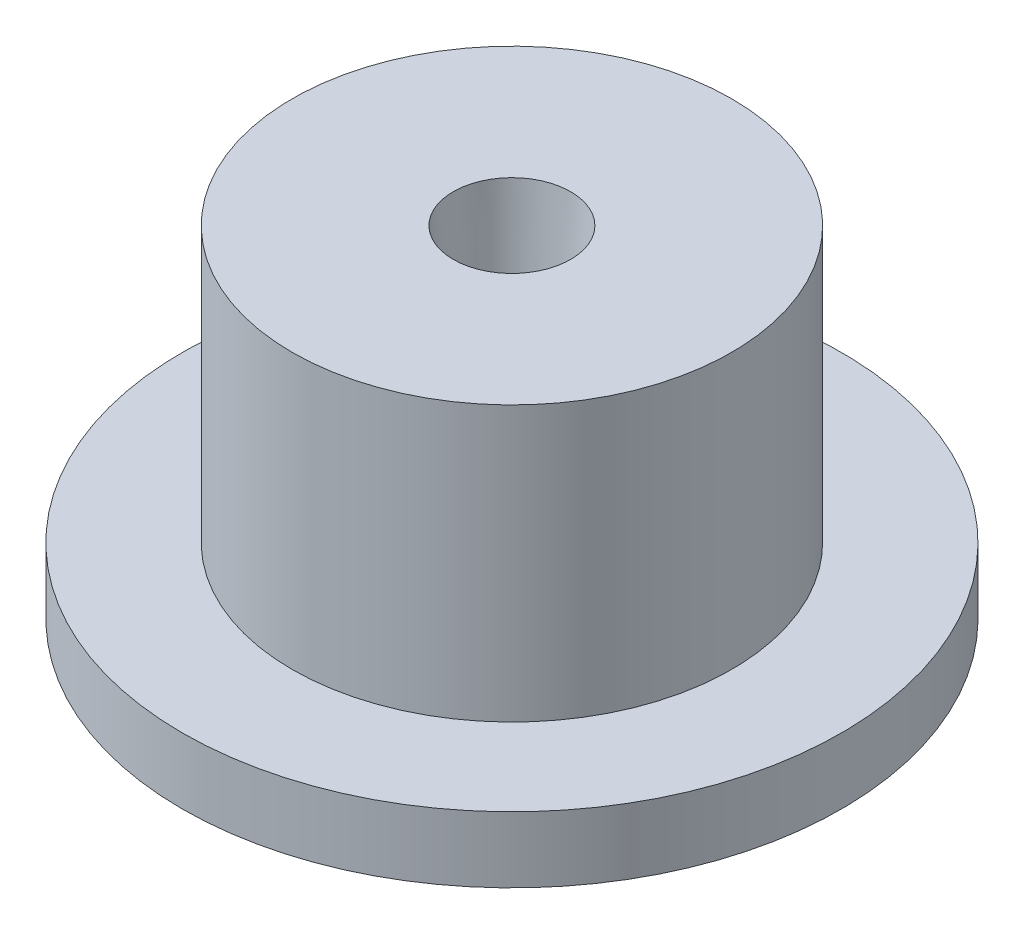
ISO-10303-21;
HEADER;
FILE_DESCRIPTION(('STEP AP214'),'2;1');
FILE_NAME('part.step','',(''),(''),'','','');
FILE_SCHEMA(('AUTOMOTIVE_DESIGN { 1 0 10303 214 1 1 1 1 }'));
ENDSEC;
DATA;
#1=APPLICATION_CONTEXT('core data for automotive mechanical design processes');
#2=APPLICATION_PROTOCOL_DEFINITION('international standard','automotive_design',2000,#1);
#3=PRODUCT_CONTEXT('',#1,'mechanical');
#4=PRODUCT('Part','Part','',(#3));
#5=PRODUCT_RELATED_PRODUCT_CATEGORY('part','',(#4));
#6=PRODUCT_DEFINITION_FORMATION('','',#4);
#7=PRODUCT_DEFINITION_CONTEXT('part definition',#1,'design');
#8=PRODUCT_DEFINITION('design','',#6,#7);
#9=PRODUCT_DEFINITION_SHAPE('','',#8);
#10=(LENGTH_UNIT() NAMED_UNIT(*) SI_UNIT(.MILLI.,.METRE.));
#11=(NAMED_UNIT(*) PLANE_ANGLE_UNIT() SI_UNIT($,.RADIAN.));
#12=(NAMED_UNIT(*) SI_UNIT($,.STERADIAN.) SOLID_ANGLE_UNIT());
#13=UNCERTAINTY_MEASURE_WITH_UNIT(LENGTH_MEASURE(1.E-05),#10,'distance_accuracy_value','');
#14=(GEOMETRIC_REPRESENTATION_CONTEXT(3) GLOBAL_UNCERTAINTY_ASSIGNED_CONTEXT((#13)) GLOBAL_UNIT_ASSIGNED_CONTEXT((#10,
#11,#12)) REPRESENTATION_CONTEXT('',''));
#15=CARTESIAN_POINT('',(0.,0.,0.));
#16=DIRECTION('',(0.,0.,1.));
#17=DIRECTION('',(1.,0.,0.));
#18=AXIS2_PLACEMENT_3D('',#15,#16,#17);
#19=CARTESIAN_POINT('',(0.,20.6666666666667,0.));
#20=DIRECTION('',(0.,1.,0.));
#21=DIRECTION('',(0.,0.,1.));
#22=AXIS2_PLACEMENT_3D('',#19,#20,#21);
#23=CYLINDRICAL_SURFACE('',#22,6.);
#24=CARTESIAN_POINT('',(0.,1.2,0.));
#25=DIRECTION('',(0.,1.,0.));
#26=DIRECTION('',(0.,0.,1.));
#27=AXIS2_PLACEMENT_3D('',#24,#25,#26);
#28=CIRCLE('',#27,6.);
#29=CARTESIAN_POINT('',(0.,1.2,6.));
#30=VERTEX_POINT('',#29);
#31=EDGE_CURVE('E10',#30,#30,#28,.T.);
#32=ORIENTED_EDGE('',*,*,#31,.F.);
#33=EDGE_LOOP('',(#32));
#34=FACE_BOUND('',#33,.T.);
#35=CARTESIAN_POINT('',(0.,0.,0.));
#36=DIRECTION('',(0.,1.,0.));
#37=DIRECTION('',(0.,0.,1.));
#38=AXIS2_PLACEMENT_3D('',#35,#36,#37);
#39=CIRCLE('',#38,6.);
#40=CARTESIAN_POINT('',(0.,0.,6.));
#41=VERTEX_POINT('',#40);
#42=EDGE_CURVE('E52',#41,#41,#39,.T.);
#43=ORIENTED_EDGE('',*,*,#42,.T.);
#44=EDGE_LOOP('',(#43));
#45=FACE_BOUND('',#44,.T.);
#46=ADVANCED_FACE('F30',(#34,#45),#23,.T.);
#47=CARTESIAN_POINT('',(6.,1.2,0.));
#48=DIRECTION('',(0.,-1.,0.));
#49=DIRECTION('',(0.,0.,-1.));
#50=AXIS2_PLACEMENT_3D('',#47,#48,#49);
#51=PLANE('',#50);
#52=CARTESIAN_POINT('',(0.,1.2,0.));
#53=DIRECTION('',(0.,1.,0.));
#54=DIRECTION('',(0.,0.,1.));
#55=AXIS2_PLACEMENT_3D('',#52,#53,#54);
#56=CIRCLE('',#55,4.);
#57=CARTESIAN_POINT('',(0.,1.2,4.));
#58=VERTEX_POINT('',#57);
#59=EDGE_CURVE('E36',#58,#58,#56,.T.);
#60=ORIENTED_EDGE('',*,*,#59,.F.);
#61=EDGE_LOOP('',(#60));
#62=FACE_BOUND('',#61,.T.);
#63=ORIENTED_EDGE('',*,*,#31,.T.);
#64=EDGE_LOOP('',(#63));
#65=FACE_BOUND('',#64,.T.);
#66=ADVANCED_FACE('F77',(#62,#65),#51,.F.);
#67=CARTESIAN_POINT('',(0.,20.6666666666667,0.));
#68=DIRECTION('',(0.,1.,0.));
#69=DIRECTION('',(0.,0.,1.));
#70=AXIS2_PLACEMENT_3D('',#67,#68,#69);
#71=CYLINDRICAL_SURFACE('',#70,4.);
#72=CARTESIAN_POINT('',(0.,6.2,0.));
#73=DIRECTION('',(0.,1.,0.));
#74=DIRECTION('',(0.,0.,1.));
#75=AXIS2_PLACEMENT_3D('',#72,#73,#74);
#76=CIRCLE('',#75,4.);
#77=CARTESIAN_POINT('',(0.,6.2,4.));
#78=VERTEX_POINT('',#77);
#79=EDGE_CURVE('E40',#78,#78,#76,.T.);
#80=ORIENTED_EDGE('',*,*,#79,.F.);
#81=EDGE_LOOP('',(#80));
#82=FACE_BOUND('',#81,.T.);
#83=ORIENTED_EDGE('',*,*,#59,.T.);
#84=EDGE_LOOP('',(#83));
#85=FACE_BOUND('',#84,.T.);
#86=ADVANCED_FACE('F72',(#82,#85),#71,.T.);
#87=CARTESIAN_POINT('',(4.,6.2,0.));
#88=DIRECTION('',(0.,-1.,0.));
#89=DIRECTION('',(0.,0.,-1.));
#90=AXIS2_PLACEMENT_3D('',#87,#88,#89);
#91=PLANE('',#90);
#92=CARTESIAN_POINT('',(0.,6.2,0.));
#93=DIRECTION('',(0.,1.,0.));
#94=DIRECTION('',(0.,0.,1.));
#95=AXIS2_PLACEMENT_3D('',#92,#93,#94);
#96=CIRCLE('',#95,1.06874062519177);
#97=CARTESIAN_POINT('',(0.,6.2,1.06874062519177));
#98=VERTEX_POINT('',#97);
#99=EDGE_CURVE('E44',#98,#98,#96,.T.);
#100=ORIENTED_EDGE('',*,*,#99,.F.);
#101=EDGE_LOOP('',(#100));
#102=FACE_BOUND('',#101,.T.);
#103=ORIENTED_EDGE('',*,*,#79,.T.);
#104=EDGE_LOOP('',(#103));
#105=FACE_BOUND('',#104,.T.);
#106=ADVANCED_FACE('F66',(#102,#105),#91,.F.);
#107=CARTESIAN_POINT('',(0.,6.2,0.));
#108=DIRECTION('',(0.,1.,0.));
#109=DIRECTION('',(0.,0.,1.));
#110=AXIS2_PLACEMENT_3D('',#107,#108,#109);
#111=CONICAL_SURFACE('',#110,1.06874062519177,0.0689771033897694);
#112=CARTESIAN_POINT('',(0.,0.,0.));
#113=DIRECTION('',(0.,1.,0.));
#114=DIRECTION('',(0.,0.,1.));
#115=AXIS2_PLACEMENT_3D('',#112,#113,#114);
#116=CIRCLE('',#115,0.640403047938266);
#117=CARTESIAN_POINT('',(0.,0.,0.640403047938266));
#118=VERTEX_POINT('',#117);
#119=EDGE_CURVE('E49',#118,#118,#116,.T.);
#120=ORIENTED_EDGE('',*,*,#119,.F.);
#121=EDGE_LOOP('',(#120));
#122=FACE_BOUND('',#121,.T.);
#123=ORIENTED_EDGE('',*,*,#99,.T.);
#124=EDGE_LOOP('',(#123));
#125=FACE_BOUND('',#124,.T.);
#126=ADVANCED_FACE('F60',(#122,#125),#111,.F.);
#127=CARTESIAN_POINT('',(0.640403047938266,0.,0.));
#128=DIRECTION('',(0.,1.,0.));
#129=DIRECTION('',(0.,0.,1.));
#130=AXIS2_PLACEMENT_3D('',#127,#128,#129);
#131=PLANE('',#130);
#132=ORIENTED_EDGE('',*,*,#42,.F.);
#133=EDGE_LOOP('',(#132));
#134=FACE_BOUND('',#133,.T.);
#135=ORIENTED_EDGE('',*,*,#119,.T.);
#136=EDGE_LOOP('',(#135));
#137=FACE_BOUND('',#136,.T.);
#138=ADVANCED_FACE('F57',(#134,#137),#131,.F.);
#139=CLOSED_SHELL('',(#46,#66,#86,#106,#126,#138));
#140=MANIFOLD_SOLID_BREP('B2',#139);
#141=ADVANCED_BREP_SHAPE_REPRESENTATION('',(#18,#140),#14);
#142=SHAPE_DEFINITION_REPRESENTATION(#9,#141);
ENDSEC;
END-ISO-10303-21;
